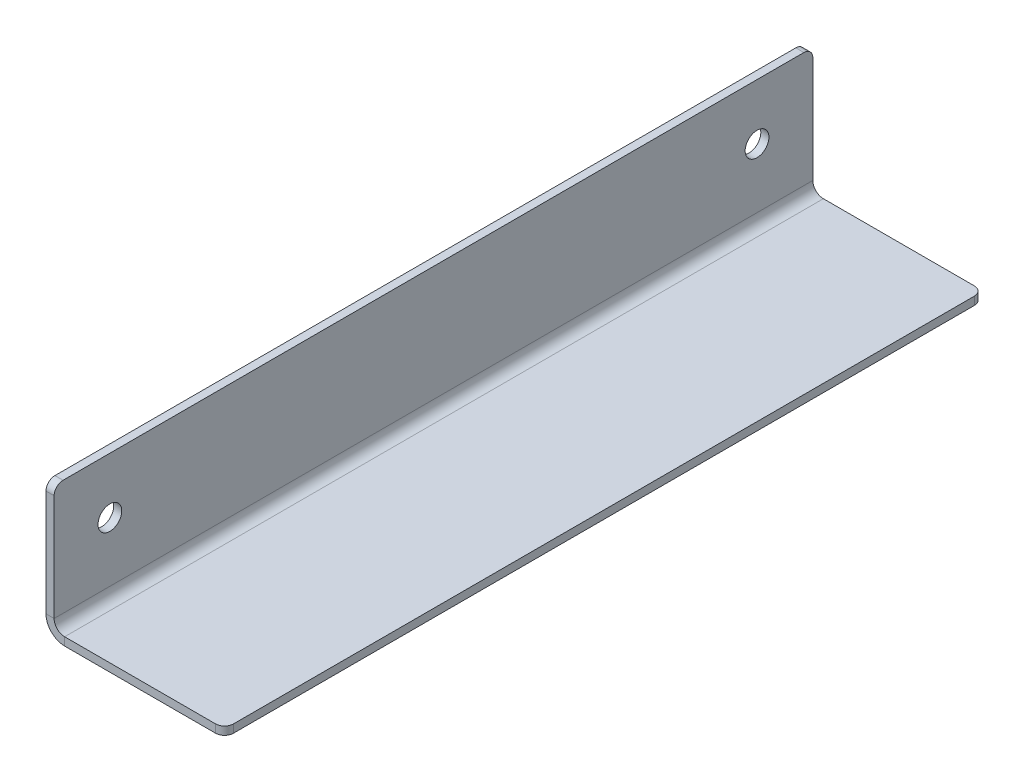
ISO-10303-21;
HEADER;
FILE_DESCRIPTION(('STEP AP214'),'2;1');
FILE_NAME('part.step','',(''),(''),'','','');
FILE_SCHEMA(('AUTOMOTIVE_DESIGN { 1 0 10303 214 1 1 1 1 }'));
ENDSEC;
DATA;
#1=APPLICATION_CONTEXT('core data for automotive mechanical design processes');
#2=APPLICATION_PROTOCOL_DEFINITION('international standard','automotive_design',2000,#1);
#3=PRODUCT_CONTEXT('',#1,'mechanical');
#4=PRODUCT('Part','Part','',(#3));
#5=PRODUCT_RELATED_PRODUCT_CATEGORY('part','',(#4));
#6=PRODUCT_DEFINITION_FORMATION('','',#4);
#7=PRODUCT_DEFINITION_CONTEXT('part definition',#1,'design');
#8=PRODUCT_DEFINITION('design','',#6,#7);
#9=PRODUCT_DEFINITION_SHAPE('','',#8);
#10=(LENGTH_UNIT() NAMED_UNIT(*) SI_UNIT(.MILLI.,.METRE.));
#11=(NAMED_UNIT(*) PLANE_ANGLE_UNIT() SI_UNIT($,.RADIAN.));
#12=(NAMED_UNIT(*) SI_UNIT($,.STERADIAN.) SOLID_ANGLE_UNIT());
#13=UNCERTAINTY_MEASURE_WITH_UNIT(LENGTH_MEASURE(1.E-05),#10,'distance_accuracy_value','');
#14=(GEOMETRIC_REPRESENTATION_CONTEXT(3) GLOBAL_UNCERTAINTY_ASSIGNED_CONTEXT((#13)) GLOBAL_UNIT_ASSIGNED_CONTEXT((#10,
#11,#12)) REPRESENTATION_CONTEXT('',''));
#15=CARTESIAN_POINT('',(0.,0.,0.));
#16=DIRECTION('',(0.,0.,1.));
#17=DIRECTION('',(1.,0.,0.));
#18=AXIS2_PLACEMENT_3D('',#15,#16,#17);
#19=CARTESIAN_POINT('',(-2.304796,0.,0.));
#20=DIRECTION('',(0.,0.,-1.));
#21=DIRECTION('',(0.,1.,0.));
#22=AXIS2_PLACEMENT_3D('',#19,#20,#21);
#23=PLANE('',#22);
#24=DIRECTION('',(0.,1.,0.));
#25=VECTOR('',#24,1.);
#26=CARTESIAN_POINT('',(-2.304796,0.,0.));
#27=LINE('',#26,#25);
#28=CARTESIAN_POINT('',(-2.304796,5.30479599999999,0.));
#29=VERTEX_POINT('',#28);
#30=CARTESIAN_POINT('',(-2.304796,35.56,0.));
#31=VERTEX_POINT('',#30);
#32=EDGE_CURVE('E210',#29,#31,#27,.T.);
#33=ORIENTED_EDGE('',*,*,#32,.T.);
#34=DIRECTION('',(1.,0.,0.));
#35=VECTOR('',#34,1.);
#36=CARTESIAN_POINT('',(-2.304796,35.56,0.));
#37=LINE('',#36,#35);
#38=CARTESIAN_POINT('',(0.,35.56,0.));
#39=VERTEX_POINT('',#38);
#40=EDGE_CURVE('E219',#31,#39,#37,.T.);
#41=ORIENTED_EDGE('',*,*,#40,.T.);
#42=DIRECTION('',(0.,1.,0.));
#43=VECTOR('',#42,1.);
#44=CARTESIAN_POINT('',(0.,0.,0.));
#45=LINE('',#44,#43);
#46=CARTESIAN_POINT('',(0.,5.30479599999999,0.));
#47=VERTEX_POINT('',#46);
#48=EDGE_CURVE('E208',#47,#39,#45,.T.);
#49=ORIENTED_EDGE('',*,*,#48,.F.);
#50=DIRECTION('',(-1.,0.,0.));
#51=VECTOR('',#50,1.);
#52=CARTESIAN_POINT('',(0.,5.30479599999999,0.));
#53=LINE('',#52,#51);
#54=EDGE_CURVE('E197',#47,#29,#53,.T.);
#55=ORIENTED_EDGE('',*,*,#54,.T.);
#56=EDGE_LOOP('',(#33,#41,#49,#55));
#57=FACE_BOUND('',#56,.T.);
#58=ADVANCED_FACE('F58',(#57),#23,.T.);
#59=CARTESIAN_POINT('',(-2.304796,0.,0.));
#60=DIRECTION('',(-1.,0.,0.));
#61=DIRECTION('',(0.,0.,1.));
#62=AXIS2_PLACEMENT_3D('',#59,#60,#61);
#63=PLANE('',#62);
#64=CARTESIAN_POINT('',(-2.304796,22.225,15.875));
#65=DIRECTION('',(-1.,0.,0.));
#66=DIRECTION('',(0.,0.,1.));
#67=AXIS2_PLACEMENT_3D('',#64,#65,#66);
#68=CIRCLE('',#67,3.37819999999999);
#69=CARTESIAN_POINT('',(-2.304796,22.225,19.2532));
#70=VERTEX_POINT('',#69);
#71=EDGE_CURVE('E501',#70,#70,#68,.T.);
#72=ORIENTED_EDGE('',*,*,#71,.F.);
#73=EDGE_LOOP('',(#72));
#74=FACE_BOUND('',#73,.T.);
#75=CARTESIAN_POINT('',(-2.304796,22.225,200.025));
#76=DIRECTION('',(-1.,0.,0.));
#77=DIRECTION('',(0.,0.,1.));
#78=AXIS2_PLACEMENT_3D('',#75,#76,#77);
#79=CIRCLE('',#78,3.37819999999999);
#80=CARTESIAN_POINT('',(-2.304796,22.225,203.4032));
#81=VERTEX_POINT('',#80);
#82=EDGE_CURVE('E228',#81,#81,#79,.T.);
#83=ORIENTED_EDGE('',*,*,#82,.F.);
#84=EDGE_LOOP('',(#83));
#85=FACE_BOUND('',#84,.T.);
#86=DIRECTION('',(0.,0.,1.));
#87=VECTOR('',#86,1.);
#88=CARTESIAN_POINT('',(-2.304796,38.1,0.));
#89=LINE('',#88,#87);
#90=CARTESIAN_POINT('',(-2.304796,38.1,2.54));
#91=VERTEX_POINT('',#90);
#92=CARTESIAN_POINT('',(-2.304796,38.1,213.36));
#93=VERTEX_POINT('',#92);
#94=EDGE_CURVE('E213',#91,#93,#89,.T.);
#95=ORIENTED_EDGE('',*,*,#94,.F.);
#96=CARTESIAN_POINT('',(-2.304796,35.56,2.54));
#97=DIRECTION('',(-1.,0.,0.));
#98=DIRECTION('',(0.,0.,1.));
#99=AXIS2_PLACEMENT_3D('',#96,#97,#98);
#100=CIRCLE('',#99,2.54);
#101=EDGE_CURVE('E242',#91,#31,#100,.T.);
#102=ORIENTED_EDGE('',*,*,#101,.T.);
#103=ORIENTED_EDGE('',*,*,#32,.F.);
#104=DIRECTION('',(0.,0.,-1.));
#105=VECTOR('',#104,1.);
#106=CARTESIAN_POINT('',(-2.304796,5.30479599999999,0.));
#107=LINE('',#106,#105);
#108=CARTESIAN_POINT('',(-2.304796,5.30479599999996,215.9));
#109=VERTEX_POINT('',#108);
#110=EDGE_CURVE('E157',#29,#109,#107,.F.);
#111=ORIENTED_EDGE('',*,*,#110,.T.);
#112=DIRECTION('',(0.,-1.,0.));
#113=VECTOR('',#112,1.);
#114=CARTESIAN_POINT('',(-2.304796,0.,215.9));
#115=LINE('',#114,#113);
#116=CARTESIAN_POINT('',(-2.304796,35.56,215.9));
#117=VERTEX_POINT('',#116);
#118=EDGE_CURVE('E217',#117,#109,#115,.T.);
#119=ORIENTED_EDGE('',*,*,#118,.F.);
#120=CARTESIAN_POINT('',(-2.304796,35.56,213.36));
#121=DIRECTION('',(-1.,0.,0.));
#122=DIRECTION('',(0.,0.,1.));
#123=AXIS2_PLACEMENT_3D('',#120,#121,#122);
#124=CIRCLE('',#123,2.54);
#125=EDGE_CURVE('E240',#117,#93,#124,.T.);
#126=ORIENTED_EDGE('',*,*,#125,.T.);
#127=EDGE_LOOP('',(#95,#102,#103,#111,#119,#126));
#128=FACE_BOUND('',#127,.T.);
#129=ADVANCED_FACE('F282',(#74,#85,#128),#63,.T.);
#130=CARTESIAN_POINT('',(0.,0.,0.));
#131=DIRECTION('',(-1.,0.,0.));
#132=DIRECTION('',(0.,0.,1.));
#133=AXIS2_PLACEMENT_3D('',#130,#131,#132);
#134=PLANE('',#133);
#135=CARTESIAN_POINT('',(0.,22.225,15.875));
#136=DIRECTION('',(-1.,0.,0.));
#137=DIRECTION('',(0.,0.,1.));
#138=AXIS2_PLACEMENT_3D('',#135,#136,#137);
#139=CIRCLE('',#138,3.37819999999999);
#140=CARTESIAN_POINT('',(0.,22.225,19.2532));
#141=VERTEX_POINT('',#140);
#142=EDGE_CURVE('E504',#141,#141,#139,.T.);
#143=ORIENTED_EDGE('',*,*,#142,.T.);
#144=EDGE_LOOP('',(#143));
#145=FACE_BOUND('',#144,.T.);
#146=CARTESIAN_POINT('',(0.,22.225,200.025));
#147=DIRECTION('',(-1.,0.,0.));
#148=DIRECTION('',(0.,0.,1.));
#149=AXIS2_PLACEMENT_3D('',#146,#147,#148);
#150=CIRCLE('',#149,3.37819999999999);
#151=CARTESIAN_POINT('',(0.,22.225,203.4032));
#152=VERTEX_POINT('',#151);
#153=EDGE_CURVE('E194',#152,#152,#150,.T.);
#154=ORIENTED_EDGE('',*,*,#153,.T.);
#155=EDGE_LOOP('',(#154));
#156=FACE_BOUND('',#155,.T.);
#157=ORIENTED_EDGE('',*,*,#48,.T.);
#158=CARTESIAN_POINT('',(0.,35.56,2.54));
#159=DIRECTION('',(-1.,0.,0.));
#160=DIRECTION('',(0.,0.,1.));
#161=AXIS2_PLACEMENT_3D('',#158,#159,#160);
#162=CIRCLE('',#161,2.54);
#163=CARTESIAN_POINT('',(0.,38.1,2.54));
#164=VERTEX_POINT('',#163);
#165=EDGE_CURVE('E233',#39,#164,#162,.F.);
#166=ORIENTED_EDGE('',*,*,#165,.T.);
#167=DIRECTION('',(0.,0.,1.));
#168=VECTOR('',#167,1.);
#169=CARTESIAN_POINT('',(0.,38.1,0.));
#170=LINE('',#169,#168);
#171=CARTESIAN_POINT('',(0.,38.1,213.36));
#172=VERTEX_POINT('',#171);
#173=EDGE_CURVE('E222',#164,#172,#170,.T.);
#174=ORIENTED_EDGE('',*,*,#173,.T.);
#175=CARTESIAN_POINT('',(0.,35.56,213.36));
#176=DIRECTION('',(-1.,0.,0.));
#177=DIRECTION('',(0.,0.,1.));
#178=AXIS2_PLACEMENT_3D('',#175,#176,#177);
#179=CIRCLE('',#178,2.54);
#180=CARTESIAN_POINT('',(0.,35.56,215.9));
#181=VERTEX_POINT('',#180);
#182=EDGE_CURVE('E231',#172,#181,#179,.F.);
#183=ORIENTED_EDGE('',*,*,#182,.T.);
#184=DIRECTION('',(0.,-1.,0.));
#185=VECTOR('',#184,1.);
#186=CARTESIAN_POINT('',(0.,0.,215.9));
#187=LINE('',#186,#185);
#188=CARTESIAN_POINT('',(0.,5.30479599999996,215.9));
#189=VERTEX_POINT('',#188);
#190=EDGE_CURVE('E214',#181,#189,#187,.T.);
#191=ORIENTED_EDGE('',*,*,#190,.T.);
#192=DIRECTION('',(0.,0.,-1.));
#193=VECTOR('',#192,1.);
#194=CARTESIAN_POINT('',(0.,5.30479599999999,0.));
#195=LINE('',#194,#193);
#196=EDGE_CURVE('E201',#47,#189,#195,.F.);
#197=ORIENTED_EDGE('',*,*,#196,.F.);
#198=EDGE_LOOP('',(#157,#166,#174,#183,#191,#197));
#199=FACE_BOUND('',#198,.T.);
#200=ADVANCED_FACE('F291',(#145,#156,#199),#134,.F.);
#201=CARTESIAN_POINT('',(-2.304796,0.,215.9));
#202=DIRECTION('',(0.,0.,1.));
#203=DIRECTION('',(1.,0.,0.));
#204=AXIS2_PLACEMENT_3D('',#201,#202,#203);
#205=PLANE('',#204);
#206=ORIENTED_EDGE('',*,*,#190,.F.);
#207=DIRECTION('',(1.,0.,0.));
#208=VECTOR('',#207,1.);
#209=CARTESIAN_POINT('',(-2.304796,35.56,215.9));
#210=LINE('',#209,#208);
#211=EDGE_CURVE('E13',#181,#117,#210,.F.);
#212=ORIENTED_EDGE('',*,*,#211,.T.);
#213=ORIENTED_EDGE('',*,*,#118,.T.);
#214=DIRECTION('',(-1.,0.,0.));
#215=VECTOR('',#214,1.);
#216=CARTESIAN_POINT('',(0.,5.30479599999996,215.9));
#217=LINE('',#216,#215);
#218=EDGE_CURVE('E205',#189,#109,#217,.T.);
#219=ORIENTED_EDGE('',*,*,#218,.F.);
#220=EDGE_LOOP('',(#206,#212,#213,#219));
#221=FACE_BOUND('',#220,.T.);
#222=ADVANCED_FACE('F276',(#221),#205,.T.);
#223=CARTESIAN_POINT('',(-2.304796,38.1,0.));
#224=DIRECTION('',(0.,1.,0.));
#225=DIRECTION('',(0.,0.,1.));
#226=AXIS2_PLACEMENT_3D('',#223,#224,#225);
#227=PLANE('',#226);
#228=ORIENTED_EDGE('',*,*,#173,.F.);
#229=DIRECTION('',(1.,0.,0.));
#230=VECTOR('',#229,1.);
#231=CARTESIAN_POINT('',(-2.304796,38.1,2.54));
#232=LINE('',#231,#230);
#233=EDGE_CURVE('E238',#164,#91,#232,.F.);
#234=ORIENTED_EDGE('',*,*,#233,.T.);
#235=ORIENTED_EDGE('',*,*,#94,.T.);
#236=DIRECTION('',(1.,0.,0.));
#237=VECTOR('',#236,1.);
#238=CARTESIAN_POINT('',(-2.304796,38.1,213.36));
#239=LINE('',#238,#237);
#240=EDGE_CURVE('E235',#93,#172,#239,.T.);
#241=ORIENTED_EDGE('',*,*,#240,.T.);
#242=EDGE_LOOP('',(#228,#234,#235,#241));
#243=FACE_BOUND('',#242,.T.);
#244=ADVANCED_FACE('F288',(#243),#227,.T.);
#245=CARTESIAN_POINT('',(3.,5.30479599999996,215.9));
#246=DIRECTION('',(0.,0.,1.));
#247=DIRECTION('',(0.,-1.,0.));
#248=AXIS2_PLACEMENT_3D('',#245,#246,#247);
#249=PLANE('',#248);
#250=DIRECTION('',(0.,1.,0.));
#251=VECTOR('',#250,1.);
#252=CARTESIAN_POINT('',(2.99999999999998,0.,215.9));
#253=LINE('',#252,#251);
#254=CARTESIAN_POINT('',(2.99999999999999,2.30479599999996,215.9));
#255=VERTEX_POINT('',#254);
#256=CARTESIAN_POINT('',(2.99999999999998,0.,215.9));
#257=VERTEX_POINT('',#256);
#258=EDGE_CURVE('E191',#255,#257,#253,.F.);
#259=ORIENTED_EDGE('',*,*,#258,.F.);
#260=CARTESIAN_POINT('',(3.,5.30479599999996,215.9));
#261=DIRECTION('',(0.,0.,-1.));
#262=DIRECTION('',(0.,1.,0.));
#263=AXIS2_PLACEMENT_3D('',#260,#261,#262);
#264=CIRCLE('',#263,3.);
#265=EDGE_CURVE('E160',#189,#255,#264,.F.);
#266=ORIENTED_EDGE('',*,*,#265,.F.);
#267=ORIENTED_EDGE('',*,*,#218,.T.);
#268=CARTESIAN_POINT('',(3.,5.30479599999996,215.9));
#269=DIRECTION('',(0.,0.,-1.));
#270=DIRECTION('',(0.,1.,0.));
#271=AXIS2_PLACEMENT_3D('',#268,#269,#270);
#272=CIRCLE('',#271,5.304796);
#273=EDGE_CURVE('E196',#109,#257,#272,.F.);
#274=ORIENTED_EDGE('',*,*,#273,.T.);
#275=EDGE_LOOP('',(#259,#266,#267,#274));
#276=FACE_BOUND('',#275,.T.);
#277=ADVANCED_FACE('F273',(#276),#249,.T.);
#278=CARTESIAN_POINT('',(3.,5.30479599999999,0.));
#279=DIRECTION('',(0.,0.,1.));
#280=DIRECTION('',(0.,-1.,0.));
#281=AXIS2_PLACEMENT_3D('',#278,#279,#280);
#282=PLANE('',#281);
#283=CARTESIAN_POINT('',(3.,5.30479599999999,0.));
#284=DIRECTION('',(0.,0.,-1.));
#285=DIRECTION('',(0.,1.,0.));
#286=AXIS2_PLACEMENT_3D('',#283,#284,#285);
#287=CIRCLE('',#286,3.);
#288=CARTESIAN_POINT('',(2.99999999999999,2.30479599999999,0.));
#289=VERTEX_POINT('',#288);
#290=EDGE_CURVE('E167',#289,#47,#287,.T.);
#291=ORIENTED_EDGE('',*,*,#290,.F.);
#292=DIRECTION('',(0.,1.,0.));
#293=VECTOR('',#292,1.);
#294=CARTESIAN_POINT('',(2.99999999999999,2.30479599999999,0.));
#295=LINE('',#294,#293);
#296=CARTESIAN_POINT('',(2.99999999999998,0.,0.));
#297=VERTEX_POINT('',#296);
#298=EDGE_CURVE('E164',#289,#297,#295,.F.);
#299=ORIENTED_EDGE('',*,*,#298,.T.);
#300=CARTESIAN_POINT('',(3.,5.30479599999999,0.));
#301=DIRECTION('',(0.,0.,-1.));
#302=DIRECTION('',(0.,1.,0.));
#303=AXIS2_PLACEMENT_3D('',#300,#301,#302);
#304=CIRCLE('',#303,5.304796);
#305=EDGE_CURVE('E149',#297,#29,#304,.T.);
#306=ORIENTED_EDGE('',*,*,#305,.T.);
#307=ORIENTED_EDGE('',*,*,#54,.F.);
#308=EDGE_LOOP('',(#291,#299,#306,#307));
#309=FACE_BOUND('',#308,.T.);
#310=ADVANCED_FACE('F165',(#309),#282,.F.);
#311=CARTESIAN_POINT('',(3.,5.30479599999999,0.));
#312=DIRECTION('',(0.,0.,-1.));
#313=DIRECTION('',(0.,-1.,0.));
#314=AXIS2_PLACEMENT_3D('',#311,#312,#313);
#315=CYLINDRICAL_SURFACE('',#314,5.304796);
#316=ORIENTED_EDGE('',*,*,#110,.F.);
#317=ORIENTED_EDGE('',*,*,#305,.F.);
#318=DIRECTION('',(0.,0.,-1.));
#319=VECTOR('',#318,1.);
#320=CARTESIAN_POINT('',(2.99999999999998,0.,215.9));
#321=LINE('',#320,#319);
#322=EDGE_CURVE('E154',#297,#257,#321,.F.);
#323=ORIENTED_EDGE('',*,*,#322,.T.);
#324=ORIENTED_EDGE('',*,*,#273,.F.);
#325=EDGE_LOOP('',(#316,#317,#323,#324));
#326=FACE_BOUND('',#325,.T.);
#327=ADVANCED_FACE('F151',(#326),#315,.T.);
#328=CARTESIAN_POINT('',(3.,5.30479599999999,0.));
#329=DIRECTION('',(0.,0.,-1.));
#330=DIRECTION('',(0.,-1.,0.));
#331=AXIS2_PLACEMENT_3D('',#328,#329,#330);
#332=CYLINDRICAL_SURFACE('',#331,3.);
#333=ORIENTED_EDGE('',*,*,#196,.T.);
#334=ORIENTED_EDGE('',*,*,#265,.T.);
#335=DIRECTION('',(0.,0.,-1.));
#336=VECTOR('',#335,1.);
#337=CARTESIAN_POINT('',(2.99999999999999,2.30479599999996,215.9));
#338=LINE('',#337,#336);
#339=EDGE_CURVE('E169',#255,#289,#338,.T.);
#340=ORIENTED_EDGE('',*,*,#339,.T.);
#341=ORIENTED_EDGE('',*,*,#290,.T.);
#342=EDGE_LOOP('',(#333,#334,#340,#341));
#343=FACE_BOUND('',#342,.T.);
#344=ADVANCED_FACE('F268',(#343),#332,.F.);
#345=CARTESIAN_POINT('',(0.,0.,215.9));
#346=DIRECTION('',(0.,0.,-1.));
#347=DIRECTION('',(0.,1.,0.));
#348=AXIS2_PLACEMENT_3D('',#345,#346,#347);
#349=PLANE('',#348);
#350=DIRECTION('',(-1.,0.,0.));
#351=VECTOR('',#350,1.);
#352=CARTESIAN_POINT('',(0.,0.,215.9));
#353=LINE('',#352,#351);
#354=CARTESIAN_POINT('',(45.955204,-1.86891861582321E-13,215.9));
#355=VERTEX_POINT('',#354);
#356=EDGE_CURVE('E174',#355,#257,#353,.T.);
#357=ORIENTED_EDGE('',*,*,#356,.F.);
#358=DIRECTION('',(0.,1.,0.));
#359=VECTOR('',#358,1.);
#360=CARTESIAN_POINT('',(45.955204,-1.86906270197376E-13,215.9));
#361=LINE('',#360,#359);
#362=CARTESIAN_POINT('',(45.955204,2.30479599999981,215.9));
#363=VERTEX_POINT('',#362);
#364=EDGE_CURVE('E66',#355,#363,#361,.T.);
#365=ORIENTED_EDGE('',*,*,#364,.T.);
#366=DIRECTION('',(1.,0.,0.));
#367=VECTOR('',#366,1.);
#368=CARTESIAN_POINT('',(0.,2.30479599999997,215.9));
#369=LINE('',#368,#367);
#370=EDGE_CURVE('E175',#363,#255,#369,.F.);
#371=ORIENTED_EDGE('',*,*,#370,.T.);
#372=ORIENTED_EDGE('',*,*,#258,.T.);
#373=EDGE_LOOP('',(#357,#365,#371,#372));
#374=FACE_BOUND('',#373,.T.);
#375=ADVANCED_FACE('F260',(#374),#349,.F.);
#376=CARTESIAN_POINT('',(48.495204,-1.69135538907739E-13,0.));
#377=DIRECTION('',(0.,0.,1.));
#378=DIRECTION('',(0.,-1.,0.));
#379=AXIS2_PLACEMENT_3D('',#376,#377,#378);
#380=PLANE('',#379);
#381=DIRECTION('',(-1.,0.,0.));
#382=VECTOR('',#381,1.);
#383=CARTESIAN_POINT('',(48.495204,2.30479599999983,0.));
#384=LINE('',#383,#382);
#385=CARTESIAN_POINT('',(45.955204,2.30479599999984,0.));
#386=VERTEX_POINT('',#385);
#387=EDGE_CURVE('E187',#289,#386,#384,.F.);
#388=ORIENTED_EDGE('',*,*,#387,.T.);
#389=DIRECTION('',(0.,1.,0.));
#390=VECTOR('',#389,1.);
#391=CARTESIAN_POINT('',(45.955204,-1.60267176307077E-13,0.));
#392=LINE('',#391,#390);
#393=CARTESIAN_POINT('',(45.955204,-1.60451737188729E-13,0.));
#394=VERTEX_POINT('',#393);
#395=EDGE_CURVE('E81',#386,#394,#392,.F.);
#396=ORIENTED_EDGE('',*,*,#395,.T.);
#397=DIRECTION('',(1.,0.,0.));
#398=VECTOR('',#397,1.);
#399=CARTESIAN_POINT('',(0.,0.,0.));
#400=LINE('',#399,#398);
#401=EDGE_CURVE('E172',#297,#394,#400,.T.);
#402=ORIENTED_EDGE('',*,*,#401,.F.);
#403=ORIENTED_EDGE('',*,*,#298,.F.);
#404=EDGE_LOOP('',(#388,#396,#402,#403));
#405=FACE_BOUND('',#404,.T.);
#406=ADVANCED_FACE('F177',(#405),#380,.F.);
#407=CARTESIAN_POINT('',(0.,0.,0.));
#408=DIRECTION('',(0.,1.,0.));
#409=DIRECTION('',(-1.,0.,0.));
#410=AXIS2_PLACEMENT_3D('',#407,#408,#409);
#411=PLANE('',#410);
#412=ORIENTED_EDGE('',*,*,#401,.T.);
#413=CARTESIAN_POINT('',(45.955204,-1.60762797475713E-13,2.53999999999999));
#414=DIRECTION('',(0.,1.,0.));
#415=DIRECTION('',(-1.,0.,0.));
#416=AXIS2_PLACEMENT_3D('',#413,#414,#415);
#417=CIRCLE('',#416,2.54);
#418=CARTESIAN_POINT('',(48.495204,-1.69631160076374E-13,2.53999999999999));
#419=VERTEX_POINT('',#418);
#420=EDGE_CURVE('E255',#394,#419,#417,.F.);
#421=ORIENTED_EDGE('',*,*,#420,.T.);
#422=DIRECTION('',(0.,0.,1.));
#423=VECTOR('',#422,1.);
#424=CARTESIAN_POINT('',(48.495204,-1.69320099789391E-13,0.));
#425=LINE('',#424,#423);
#426=CARTESIAN_POINT('',(48.495204,-1.95449163895999E-13,213.36));
#427=VERTEX_POINT('',#426);
#428=EDGE_CURVE('E178',#419,#427,#425,.T.);
#429=ORIENTED_EDGE('',*,*,#428,.T.);
#430=CARTESIAN_POINT('',(45.955204,-1.86580801295337E-13,213.36));
#431=DIRECTION('',(0.,1.,0.));
#432=DIRECTION('',(-1.,0.,0.));
#433=AXIS2_PLACEMENT_3D('',#430,#431,#432);
#434=CIRCLE('',#433,2.54);
#435=EDGE_CURVE('E73',#427,#355,#434,.F.);
#436=ORIENTED_EDGE('',*,*,#435,.T.);
#437=ORIENTED_EDGE('',*,*,#356,.T.);
#438=ORIENTED_EDGE('',*,*,#322,.F.);
#439=EDGE_LOOP('',(#412,#421,#429,#436,#437,#438));
#440=FACE_BOUND('',#439,.T.);
#441=ADVANCED_FACE('F171',(#440),#411,.F.);
#442=CARTESIAN_POINT('',(0.,2.304796,0.));
#443=DIRECTION('',(0.,1.,0.));
#444=DIRECTION('',(-1.,0.,0.));
#445=AXIS2_PLACEMENT_3D('',#442,#443,#444);
#446=PLANE('',#445);
#447=DIRECTION('',(0.,0.,-1.));
#448=VECTOR('',#447,1.);
#449=CARTESIAN_POINT('',(48.495204,2.3047959999998,215.9));
#450=LINE('',#449,#448);
#451=CARTESIAN_POINT('',(48.495204,2.30479599999983,2.53999999999999));
#452=VERTEX_POINT('',#451);
#453=CARTESIAN_POINT('',(48.495204,2.3047959999998,213.36));
#454=VERTEX_POINT('',#453);
#455=EDGE_CURVE('E181',#452,#454,#450,.F.);
#456=ORIENTED_EDGE('',*,*,#455,.F.);
#457=CARTESIAN_POINT('',(45.955204,2.30479599999984,2.53999999999999));
#458=DIRECTION('',(0.,1.,0.));
#459=DIRECTION('',(-1.,0.,0.));
#460=AXIS2_PLACEMENT_3D('',#457,#458,#459);
#461=CIRCLE('',#460,2.54);
#462=EDGE_CURVE('E251',#452,#386,#461,.T.);
#463=ORIENTED_EDGE('',*,*,#462,.T.);
#464=ORIENTED_EDGE('',*,*,#387,.F.);
#465=ORIENTED_EDGE('',*,*,#339,.F.);
#466=ORIENTED_EDGE('',*,*,#370,.F.);
#467=CARTESIAN_POINT('',(45.955204,2.30479599999981,213.36));
#468=DIRECTION('',(0.,1.,0.));
#469=DIRECTION('',(-1.,0.,0.));
#470=AXIS2_PLACEMENT_3D('',#467,#468,#469);
#471=CIRCLE('',#470,2.54);
#472=EDGE_CURVE('E249',#363,#454,#471,.T.);
#473=ORIENTED_EDGE('',*,*,#472,.T.);
#474=EDGE_LOOP('',(#456,#463,#464,#465,#466,#473));
#475=FACE_BOUND('',#474,.T.);
#476=ADVANCED_FACE('F266',(#475),#446,.T.);
#477=CARTESIAN_POINT('',(48.495204,-1.95590071916385E-13,215.9));
#478=DIRECTION('',(-1.,0.,0.));
#479=DIRECTION('',(0.,-1.,0.));
#480=AXIS2_PLACEMENT_3D('',#477,#478,#479);
#481=PLANE('',#480);
#482=ORIENTED_EDGE('',*,*,#428,.F.);
#483=DIRECTION('',(0.,1.,0.));
#484=VECTOR('',#483,1.);
#485=CARTESIAN_POINT('',(48.495204,-1.69461007809777E-13,2.53999999999999));
#486=LINE('',#485,#484);
#487=EDGE_CURVE('E246',#419,#452,#486,.T.);
#488=ORIENTED_EDGE('',*,*,#487,.T.);
#489=ORIENTED_EDGE('',*,*,#455,.T.);
#490=DIRECTION('',(0.,1.,0.));
#491=VECTOR('',#490,1.);
#492=CARTESIAN_POINT('',(48.495204,-1.95279011629402E-13,213.36));
#493=LINE('',#492,#491);
#494=EDGE_CURVE('E244',#454,#427,#493,.F.);
#495=ORIENTED_EDGE('',*,*,#494,.T.);
#496=EDGE_LOOP('',(#482,#488,#489,#495));
#497=FACE_BOUND('',#496,.T.);
#498=ADVANCED_FACE('F322',(#497),#481,.F.);
#499=CARTESIAN_POINT('',(-2.304796,22.225,200.025));
#500=DIRECTION('',(-1.,0.,0.));
#501=DIRECTION('',(0.,0.,1.));
#502=AXIS2_PLACEMENT_3D('',#499,#500,#501);
#503=CYLINDRICAL_SURFACE('',#502,3.37819999999999);
#504=ORIENTED_EDGE('',*,*,#82,.T.);
#505=EDGE_LOOP('',(#504));
#506=FACE_BOUND('',#505,.T.);
#507=ORIENTED_EDGE('',*,*,#153,.F.);
#508=EDGE_LOOP('',(#507));
#509=FACE_BOUND('',#508,.T.);
#510=ADVANCED_FACE('F325',(#506,#509),#503,.F.);
#511=CARTESIAN_POINT('',(-2.304796,22.225,15.875));
#512=DIRECTION('',(-1.,0.,0.));
#513=DIRECTION('',(0.,0.,1.));
#514=AXIS2_PLACEMENT_3D('',#511,#512,#513);
#515=CYLINDRICAL_SURFACE('',#514,3.37819999999999);
#516=ORIENTED_EDGE('',*,*,#71,.T.);
#517=EDGE_LOOP('',(#516));
#518=FACE_BOUND('',#517,.T.);
#519=ORIENTED_EDGE('',*,*,#142,.F.);
#520=EDGE_LOOP('',(#519));
#521=FACE_BOUND('',#520,.T.);
#522=ADVANCED_FACE('F311',(#518,#521),#515,.F.);
#523=CARTESIAN_POINT('',(-2.304796,35.56,2.54));
#524=DIRECTION('',(1.,0.,0.));
#525=DIRECTION('',(0.,0.,-1.));
#526=AXIS2_PLACEMENT_3D('',#523,#524,#525);
#527=CYLINDRICAL_SURFACE('',#526,2.54);
#528=ORIENTED_EDGE('',*,*,#101,.F.);
#529=ORIENTED_EDGE('',*,*,#233,.F.);
#530=ORIENTED_EDGE('',*,*,#165,.F.);
#531=ORIENTED_EDGE('',*,*,#40,.F.);
#532=EDGE_LOOP('',(#528,#529,#530,#531));
#533=FACE_BOUND('',#532,.T.);
#534=ADVANCED_FACE('F296',(#533),#527,.T.);
#535=CARTESIAN_POINT('',(45.955204,-1.60592645209116E-13,2.53999999999999));
#536=DIRECTION('',(0.,1.,0.));
#537=DIRECTION('',(-1.,0.,0.));
#538=AXIS2_PLACEMENT_3D('',#535,#536,#537);
#539=CYLINDRICAL_SURFACE('',#538,2.54);
#540=ORIENTED_EDGE('',*,*,#420,.F.);
#541=ORIENTED_EDGE('',*,*,#395,.F.);
#542=ORIENTED_EDGE('',*,*,#462,.F.);
#543=ORIENTED_EDGE('',*,*,#487,.F.);
#544=EDGE_LOOP('',(#540,#541,#542,#543));
#545=FACE_BOUND('',#544,.T.);
#546=ADVANCED_FACE('F310',(#545),#539,.T.);
#547=CARTESIAN_POINT('',(45.955204,-1.86595209910392E-13,213.36));
#548=DIRECTION('',(0.,1.,0.));
#549=DIRECTION('',(-1.,0.,0.));
#550=AXIS2_PLACEMENT_3D('',#547,#548,#549);
#551=CYLINDRICAL_SURFACE('',#550,2.54);
#552=ORIENTED_EDGE('',*,*,#435,.F.);
#553=ORIENTED_EDGE('',*,*,#494,.F.);
#554=ORIENTED_EDGE('',*,*,#472,.F.);
#555=ORIENTED_EDGE('',*,*,#364,.F.);
#556=EDGE_LOOP('',(#552,#553,#554,#555));
#557=FACE_BOUND('',#556,.T.);
#558=ADVANCED_FACE('F313',(#557),#551,.T.);
#559=CARTESIAN_POINT('',(-2.304796,35.56,213.36));
#560=DIRECTION('',(1.,0.,0.));
#561=DIRECTION('',(0.,0.,-1.));
#562=AXIS2_PLACEMENT_3D('',#559,#560,#561);
#563=CYLINDRICAL_SURFACE('',#562,2.54);
#564=ORIENTED_EDGE('',*,*,#125,.F.);
#565=ORIENTED_EDGE('',*,*,#211,.F.);
#566=ORIENTED_EDGE('',*,*,#182,.F.);
#567=ORIENTED_EDGE('',*,*,#240,.F.);
#568=EDGE_LOOP('',(#564,#565,#566,#567));
#569=FACE_BOUND('',#568,.T.);
#570=ADVANCED_FACE('F60',(#569),#563,.T.);
#571=CLOSED_SHELL('',(#58,#129,#200,#222,#244,#277,#310,#327,#344,#375,#406,#441,#476,#498,#510,
#522,#534,#546,#558,#570));
#572=MANIFOLD_SOLID_BREP('B2',#571);
#573=ADVANCED_BREP_SHAPE_REPRESENTATION('',(#18,#572),#14);
#574=SHAPE_DEFINITION_REPRESENTATION(#9,#573);
ENDSEC;
END-ISO-10303-21;
